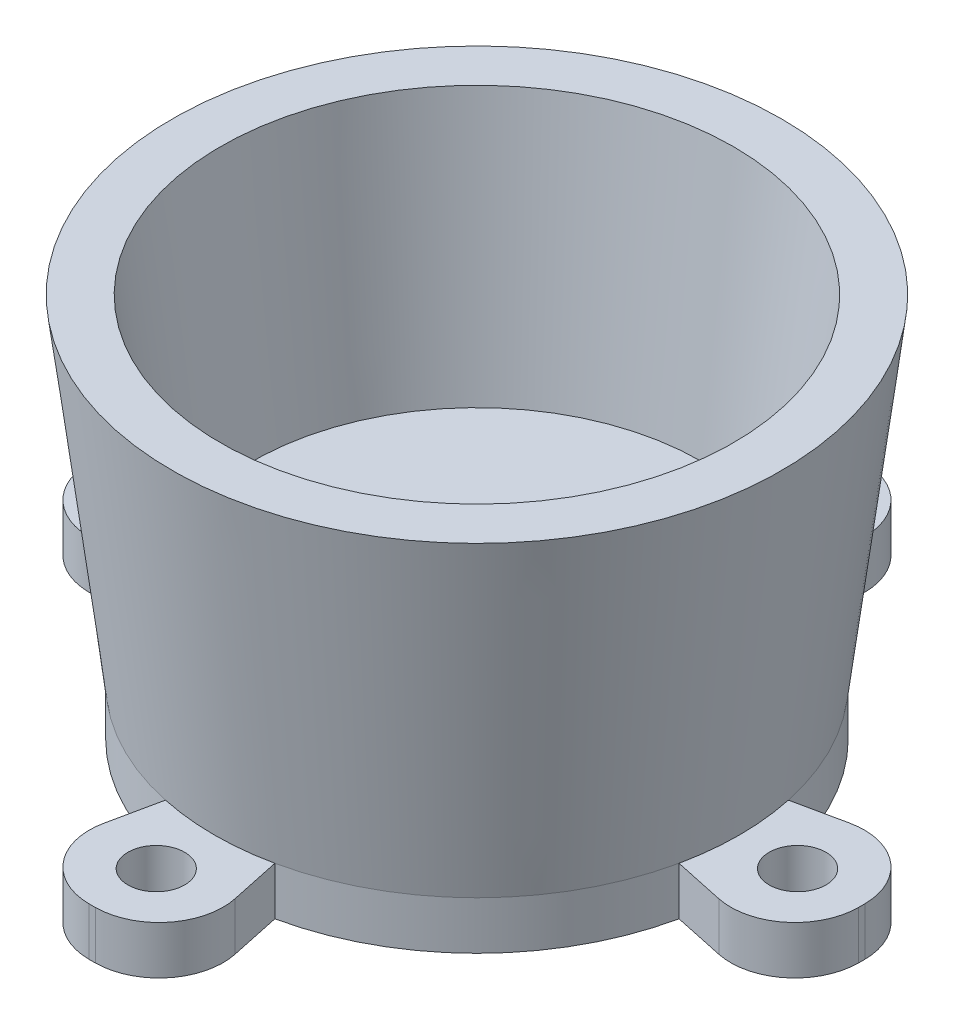
ISO-10303-21;
HEADER;
FILE_DESCRIPTION(('STEP AP214'),'2;1');
FILE_NAME('part.step','',(''),(''),'','','');
FILE_SCHEMA(('AUTOMOTIVE_DESIGN { 1 0 10303 214 1 1 1 1 }'));
ENDSEC;
DATA;
#1=APPLICATION_CONTEXT('core data for automotive mechanical design processes');
#2=APPLICATION_PROTOCOL_DEFINITION('international standard','automotive_design',2000,#1);
#3=PRODUCT_CONTEXT('',#1,'mechanical');
#4=PRODUCT('Part','Part','',(#3));
#5=PRODUCT_RELATED_PRODUCT_CATEGORY('part','',(#4));
#6=PRODUCT_DEFINITION_FORMATION('','',#4);
#7=PRODUCT_DEFINITION_CONTEXT('part definition',#1,'design');
#8=PRODUCT_DEFINITION('design','',#6,#7);
#9=PRODUCT_DEFINITION_SHAPE('','',#8);
#10=(LENGTH_UNIT() NAMED_UNIT(*) SI_UNIT(.MILLI.,.METRE.));
#11=(NAMED_UNIT(*) PLANE_ANGLE_UNIT() SI_UNIT($,.RADIAN.));
#12=(NAMED_UNIT(*) SI_UNIT($,.STERADIAN.) SOLID_ANGLE_UNIT());
#13=UNCERTAINTY_MEASURE_WITH_UNIT(LENGTH_MEASURE(1.E-05),#10,'distance_accuracy_value','');
#14=(GEOMETRIC_REPRESENTATION_CONTEXT(3) GLOBAL_UNCERTAINTY_ASSIGNED_CONTEXT((#13)) GLOBAL_UNIT_ASSIGNED_CONTEXT((#10,
#11,#12)) REPRESENTATION_CONTEXT('',''));
#15=CARTESIAN_POINT('',(0.,0.,0.));
#16=DIRECTION('',(0.,0.,1.));
#17=DIRECTION('',(1.,0.,0.));
#18=AXIS2_PLACEMENT_3D('',#15,#16,#17);
#19=CARTESIAN_POINT('',(3.01625,-6.35,0.));
#20=DIRECTION('',(0.,1.,0.));
#21=DIRECTION('',(0.,0.,1.));
#22=AXIS2_PLACEMENT_3D('',#19,#20,#21);
#23=PLANE('',#22);
#24=DIRECTION('',(0.208333333333331,0.,-0.978057882858792));
#25=VECTOR('',#24,1.);
#26=CARTESIAN_POINT('',(-22.1125520833333,-6.35,20.3399362464021));
#27=LINE('',#26,#25);
#28=CARTESIAN_POINT('',(-22.964753288891,-6.35,24.3407463594142));
#29=VERTEX_POINT('',#28);
#30=CARTESIAN_POINT('',(-22.1125520833333,-6.35,20.3399362464021));
#31=VERTEX_POINT('',#30);
#32=EDGE_CURVE('E346',#29,#31,#27,.T.);
#33=ORIENTED_EDGE('',*,*,#32,.F.);
#34=CARTESIAN_POINT('',(-17.9962192439684,-6.35,25.3990796927475));
#35=DIRECTION('',(0.,1.,0.));
#36=DIRECTION('',(0.,0.,1.));
#37=AXIS2_PLACEMENT_3D('',#34,#35,#36);
#38=CIRCLE('',#37,5.08);
#39=CARTESIAN_POINT('',(-18.0394630927621,-6.35,30.478895631297));
#40=VERTEX_POINT('',#39);
#41=EDGE_CURVE('E60',#29,#40,#38,.T.);
#42=ORIENTED_EDGE('',*,*,#41,.T.);
#43=CARTESIAN_POINT('',(-17.78,-6.35,0.));
#44=DIRECTION('',(0.,-1.,0.));
#45=DIRECTION('',(0.,0.,-1.));
#46=AXIS2_PLACEMENT_3D('',#43,#44,#45);
#47=CIRCLE('',#46,30.48);
#48=CARTESIAN_POINT('',(-17.5205369072379,-6.35,30.478895631297));
#49=VERTEX_POINT('',#48);
#50=EDGE_CURVE('E250',#49,#40,#47,.T.);
#51=ORIENTED_EDGE('',*,*,#50,.F.);
#52=CARTESIAN_POINT('',(-17.5637807560316,-6.35,25.3990796927475));
#53=DIRECTION('',(0.,1.,0.));
#54=DIRECTION('',(0.,0.,1.));
#55=AXIS2_PLACEMENT_3D('',#52,#53,#54);
#56=CIRCLE('',#55,5.08);
#57=CARTESIAN_POINT('',(-12.5952467111089,-6.35,24.3407463594142));
#58=VERTEX_POINT('',#57);
#59=EDGE_CURVE('E54',#49,#58,#56,.T.);
#60=ORIENTED_EDGE('',*,*,#59,.T.);
#61=DIRECTION('',(0.208333333333332,0.,0.978057882858792));
#62=VECTOR('',#61,1.);
#63=CARTESIAN_POINT('',(-13.4474479166666,-6.35,20.3399362464021));
#64=LINE('',#63,#62);
#65=CARTESIAN_POINT('',(-13.4474479166666,-6.35,20.3399362464021));
#66=VERTEX_POINT('',#65);
#67=EDGE_CURVE('E392',#66,#58,#64,.T.);
#68=ORIENTED_EDGE('',*,*,#67,.F.);
#69=CARTESIAN_POINT('',(-17.78,-6.35,0.));
#70=DIRECTION('',(0.,-1.,0.));
#71=DIRECTION('',(0.,0.,-1.));
#72=AXIS2_PLACEMENT_3D('',#69,#70,#71);
#73=CIRCLE('',#72,20.79625);
#74=EDGE_CURVE('E240',#66,#31,#73,.T.);
#75=ORIENTED_EDGE('',*,*,#74,.T.);
#76=EDGE_LOOP('',(#33,#42,#51,#60,#68,#75));
#77=FACE_BOUND('',#76,.T.);
#78=CARTESIAN_POINT('',(-17.78,-6.35,25.4));
#79=DIRECTION('',(0.,1.,0.));
#80=DIRECTION('',(0.,0.,1.));
#81=AXIS2_PLACEMENT_3D('',#78,#79,#80);
#82=CIRCLE('',#81,2.2479);
#83=CARTESIAN_POINT('',(-17.78,-6.35,27.6479));
#84=VERTEX_POINT('',#83);
#85=EDGE_CURVE('E367',#84,#84,#82,.T.);
#86=ORIENTED_EDGE('',*,*,#85,.F.);
#87=EDGE_LOOP('',(#86));
#88=FACE_BOUND('',#87,.T.);
#89=ADVANCED_FACE('F39',(#77,#88),#23,.T.);
#90=CARTESIAN_POINT('',(-18.0394630927621,-6.35,-30.478895631297));
#91=VERTEX_POINT('',#90);
#92=CARTESIAN_POINT('',(-17.5205369072379,-6.35,-30.478895631297));
#93=VERTEX_POINT('',#92);
#94=EDGE_CURVE('E412',#91,#93,#47,.T.);
#95=ORIENTED_EDGE('',*,*,#94,.F.);
#96=CARTESIAN_POINT('',(-17.9962192439684,-6.35,-25.3990796927475));
#97=DIRECTION('',(0.,1.,0.));
#98=DIRECTION('',(0.,0.,1.));
#99=AXIS2_PLACEMENT_3D('',#96,#97,#98);
#100=CIRCLE('',#99,5.08);
#101=CARTESIAN_POINT('',(-22.964753288891,-6.35,-24.3407463594142));
#102=VERTEX_POINT('',#101);
#103=EDGE_CURVE('E306',#91,#102,#100,.T.);
#104=ORIENTED_EDGE('',*,*,#103,.T.);
#105=DIRECTION('',(-0.208333333333331,0.,-0.978057882858792));
#106=VECTOR('',#105,1.);
#107=CARTESIAN_POINT('',(-22.1125520833333,-6.35,-20.3399362464021));
#108=LINE('',#107,#106);
#109=CARTESIAN_POINT('',(-22.1125520833333,-6.35,-20.3399362464021));
#110=VERTEX_POINT('',#109);
#111=EDGE_CURVE('E210',#110,#102,#108,.T.);
#112=ORIENTED_EDGE('',*,*,#111,.F.);
#113=CARTESIAN_POINT('',(-13.4474479166666,-6.35,-20.3399362464021));
#114=VERTEX_POINT('',#113);
#115=EDGE_CURVE('E231',#110,#114,#73,.T.);
#116=ORIENTED_EDGE('',*,*,#115,.T.);
#117=DIRECTION('',(-0.208333333333332,0.,0.978057882858792));
#118=VECTOR('',#117,1.);
#119=CARTESIAN_POINT('',(-13.4474479166666,-6.35,-20.3399362464021));
#120=LINE('',#119,#118);
#121=CARTESIAN_POINT('',(-12.5952467111089,-6.35,-24.3407463594142));
#122=VERTEX_POINT('',#121);
#123=EDGE_CURVE('E456',#122,#114,#120,.T.);
#124=ORIENTED_EDGE('',*,*,#123,.F.);
#125=CARTESIAN_POINT('',(-17.5637807560316,-6.35,-25.3990796927475));
#126=DIRECTION('',(0.,1.,0.));
#127=DIRECTION('',(0.,0.,1.));
#128=AXIS2_PLACEMENT_3D('',#125,#126,#127);
#129=CIRCLE('',#128,5.08);
#130=EDGE_CURVE('E304',#122,#93,#129,.T.);
#131=ORIENTED_EDGE('',*,*,#130,.T.);
#132=EDGE_LOOP('',(#95,#104,#112,#116,#124,#131));
#133=FACE_BOUND('',#132,.T.);
#134=CARTESIAN_POINT('',(-17.78,-6.35,-25.4));
#135=DIRECTION('',(0.,1.,0.));
#136=DIRECTION('',(0.,0.,-1.));
#137=AXIS2_PLACEMENT_3D('',#134,#135,#136);
#138=CIRCLE('',#137,2.2479);
#139=CARTESIAN_POINT('',(-17.78,-6.35,-27.6479));
#140=VERTEX_POINT('',#139);
#141=EDGE_CURVE('E374',#140,#140,#138,.T.);
#142=ORIENTED_EDGE('',*,*,#141,.F.);
#143=EDGE_LOOP('',(#142));
#144=FACE_BOUND('',#143,.T.);
#145=ADVANCED_FACE('F516',(#133,#144),#23,.T.);
#146=CARTESIAN_POINT('',(-48.258895631297,-6.35,0.259463092762078));
#147=VERTEX_POINT('',#146);
#148=CARTESIAN_POINT('',(-48.258895631297,-6.35,-0.259463092762078));
#149=VERTEX_POINT('',#148);
#150=EDGE_CURVE('E416',#147,#149,#47,.T.);
#151=ORIENTED_EDGE('',*,*,#150,.F.);
#152=CARTESIAN_POINT('',(-43.1790796927475,-6.35,0.216219243968399));
#153=DIRECTION('',(0.,1.,0.));
#154=DIRECTION('',(0.,0.,1.));
#155=AXIS2_PLACEMENT_3D('',#152,#153,#154);
#156=CIRCLE('',#155,5.08);
#157=CARTESIAN_POINT('',(-42.1207463594141,-6.35,5.18475328889106));
#158=VERTEX_POINT('',#157);
#159=EDGE_CURVE('E267',#147,#158,#156,.T.);
#160=ORIENTED_EDGE('',*,*,#159,.T.);
#161=DIRECTION('',(-0.978057882858792,0.,0.208333333333334));
#162=VECTOR('',#161,1.);
#163=CARTESIAN_POINT('',(-47.591204269536,-6.35,6.35));
#164=LINE('',#163,#162);
#165=CARTESIAN_POINT('',(-38.1199362464021,-6.35,4.33255208333334));
#166=VERTEX_POINT('',#165);
#167=EDGE_CURVE('E239',#166,#158,#164,.T.);
#168=ORIENTED_EDGE('',*,*,#167,.F.);
#169=CARTESIAN_POINT('',(-38.1199362464021,-6.35,-4.33255208333334));
#170=VERTEX_POINT('',#169);
#171=EDGE_CURVE('E229',#166,#170,#73,.T.);
#172=ORIENTED_EDGE('',*,*,#171,.T.);
#173=DIRECTION('',(0.978057882858792,0.,0.208333333333334));
#174=VECTOR('',#173,1.);
#175=CARTESIAN_POINT('',(-47.591204269536,-6.35,-6.35));
#176=LINE('',#175,#174);
#177=CARTESIAN_POINT('',(-42.1207463594141,-6.35,-5.18475328889106));
#178=VERTEX_POINT('',#177);
#179=EDGE_CURVE('E200',#178,#170,#176,.T.);
#180=ORIENTED_EDGE('',*,*,#179,.F.);
#181=CARTESIAN_POINT('',(-43.1790796927475,-6.35,-0.216219243968399));
#182=DIRECTION('',(0.,1.,0.));
#183=DIRECTION('',(0.,0.,1.));
#184=AXIS2_PLACEMENT_3D('',#181,#182,#183);
#185=CIRCLE('',#184,5.08);
#186=EDGE_CURVE('E265',#178,#149,#185,.T.);
#187=ORIENTED_EDGE('',*,*,#186,.T.);
#188=EDGE_LOOP('',(#151,#160,#168,#172,#180,#187));
#189=FACE_BOUND('',#188,.T.);
#190=CARTESIAN_POINT('',(-43.18,-6.35,0.));
#191=DIRECTION('',(0.,1.,0.));
#192=DIRECTION('',(0.,0.,1.));
#193=AXIS2_PLACEMENT_3D('',#190,#191,#192);
#194=CIRCLE('',#193,2.2479);
#195=CARTESIAN_POINT('',(-43.18,-6.35,2.2479));
#196=VERTEX_POINT('',#195);
#197=EDGE_CURVE('E221',#196,#196,#194,.T.);
#198=ORIENTED_EDGE('',*,*,#197,.F.);
#199=EDGE_LOOP('',(#198));
#200=FACE_BOUND('',#199,.T.);
#201=ADVANCED_FACE('F236',(#189,#200),#23,.T.);
#202=CARTESIAN_POINT('',(-17.78,-37.2110456847174,0.));
#203=DIRECTION('',(0.,-1.,0.));
#204=DIRECTION('',(0.,0.,-1.));
#205=AXIS2_PLACEMENT_3D('',#202,#203,#204);
#206=CYLINDRICAL_SURFACE('',#205,30.48);
#207=ORIENTED_EDGE('',*,*,#50,.T.);
#208=DIRECTION('',(0.,-1.,0.));
#209=VECTOR('',#208,1.);
#210=CARTESIAN_POINT('',(-18.0394630927621,-37.2110456847174,30.478895631297));
#211=LINE('',#210,#209);
#212=CARTESIAN_POINT('',(-18.0394630927621,-10.16,30.478895631297));
#213=VERTEX_POINT('',#212);
#214=EDGE_CURVE('E47',#40,#213,#211,.T.);
#215=ORIENTED_EDGE('',*,*,#214,.T.);
#216=CARTESIAN_POINT('',(-17.78,-10.16,0.));
#217=DIRECTION('',(0.,-1.,0.));
#218=DIRECTION('',(0.,0.,-1.));
#219=AXIS2_PLACEMENT_3D('',#216,#217,#218);
#220=CIRCLE('',#219,30.48);
#221=CARTESIAN_POINT('',(-17.5205369072379,-10.16,30.478895631297));
#222=VERTEX_POINT('',#221);
#223=EDGE_CURVE('E328',#222,#213,#220,.T.);
#224=ORIENTED_EDGE('',*,*,#223,.F.);
#225=DIRECTION('',(0.,-1.,0.));
#226=VECTOR('',#225,1.);
#227=CARTESIAN_POINT('',(-17.5205369072379,-37.2110456847174,30.478895631297));
#228=LINE('',#227,#226);
#229=EDGE_CURVE('E321',#222,#49,#228,.F.);
#230=ORIENTED_EDGE('',*,*,#229,.T.);
#231=EDGE_LOOP('',(#207,#215,#224,#230));
#232=FACE_BOUND('',#231,.T.);
#233=ADVANCED_FACE('F327',(#232),#206,.T.);
#234=CARTESIAN_POINT('',(-18.0394630927621,-10.16,-30.478895631297));
#235=VERTEX_POINT('',#234);
#236=CARTESIAN_POINT('',(-17.5205369072379,-10.16,-30.478895631297));
#237=VERTEX_POINT('',#236);
#238=EDGE_CURVE('E404',#235,#237,#220,.T.);
#239=ORIENTED_EDGE('',*,*,#238,.F.);
#240=DIRECTION('',(0.,-1.,0.));
#241=VECTOR('',#240,1.);
#242=CARTESIAN_POINT('',(-18.0394630927621,-37.2110456847174,-30.478895631297));
#243=LINE('',#242,#241);
#244=EDGE_CURVE('E301',#235,#91,#243,.F.);
#245=ORIENTED_EDGE('',*,*,#244,.T.);
#246=ORIENTED_EDGE('',*,*,#94,.T.);
#247=DIRECTION('',(0.,-1.,0.));
#248=VECTOR('',#247,1.);
#249=CARTESIAN_POINT('',(-17.5205369072379,-37.2110456847174,-30.478895631297));
#250=LINE('',#249,#248);
#251=EDGE_CURVE('E299',#93,#237,#250,.T.);
#252=ORIENTED_EDGE('',*,*,#251,.T.);
#253=EDGE_LOOP('',(#239,#245,#246,#252));
#254=FACE_BOUND('',#253,.T.);
#255=ADVANCED_FACE('F537',(#254),#206,.T.);
#256=CARTESIAN_POINT('',(-48.258895631297,-10.16,0.259463092762078));
#257=VERTEX_POINT('',#256);
#258=CARTESIAN_POINT('',(-48.258895631297,-10.16,-0.259463092762078));
#259=VERTEX_POINT('',#258);
#260=EDGE_CURVE('E340',#257,#259,#220,.T.);
#261=ORIENTED_EDGE('',*,*,#260,.F.);
#262=DIRECTION('',(0.,-1.,0.));
#263=VECTOR('',#262,1.);
#264=CARTESIAN_POINT('',(-48.258895631297,-37.2110456847174,0.259463092762078));
#265=LINE('',#264,#263);
#266=EDGE_CURVE('E262',#257,#147,#265,.F.);
#267=ORIENTED_EDGE('',*,*,#266,.T.);
#268=ORIENTED_EDGE('',*,*,#150,.T.);
#269=DIRECTION('',(0.,-1.,0.));
#270=VECTOR('',#269,1.);
#271=CARTESIAN_POINT('',(-48.258895631297,-37.2110456847174,-0.259463092762078));
#272=LINE('',#271,#270);
#273=EDGE_CURVE('E260',#149,#259,#272,.T.);
#274=ORIENTED_EDGE('',*,*,#273,.T.);
#275=EDGE_LOOP('',(#261,#267,#268,#274));
#276=FACE_BOUND('',#275,.T.);
#277=ADVANCED_FACE('F499',(#276),#206,.T.);
#278=CARTESIAN_POINT('',(-17.78,0.,0.));
#279=DIRECTION('',(0.,1.,0.));
#280=DIRECTION('',(0.,0.,1.));
#281=AXIS2_PLACEMENT_3D('',#278,#279,#280);
#282=PLANE('',#281);
#283=CARTESIAN_POINT('',(-17.78,0.,0.));
#284=DIRECTION('',(0.,-1.,0.));
#285=DIRECTION('',(0.,0.,-1.));
#286=AXIS2_PLACEMENT_3D('',#283,#284,#285);
#287=CIRCLE('',#286,17.78);
#288=CARTESIAN_POINT('',(-17.78,0.,-17.78));
#289=VERTEX_POINT('',#288);
#290=EDGE_CURVE('E257',#289,#289,#287,.T.);
#291=ORIENTED_EDGE('',*,*,#290,.F.);
#292=EDGE_LOOP('',(#291));
#293=FACE_BOUND('',#292,.T.);
#294=ADVANCED_FACE('F824',(#293),#282,.T.);
#295=CARTESIAN_POINT('',(-17.78,20.32,0.));
#296=DIRECTION('',(0.,1.,0.));
#297=DIRECTION('',(0.,0.,1.));
#298=AXIS2_PLACEMENT_3D('',#295,#296,#297);
#299=CONICAL_SURFACE('',#298,20.32,0.124354994546762);
#300=ORIENTED_EDGE('',*,*,#290,.T.);
#301=EDGE_LOOP('',(#300));
#302=FACE_BOUND('',#301,.T.);
#303=CARTESIAN_POINT('',(-17.78,20.32,0.));
#304=DIRECTION('',(0.,-1.,0.));
#305=DIRECTION('',(0.,0.,-1.));
#306=AXIS2_PLACEMENT_3D('',#303,#304,#305);
#307=CIRCLE('',#306,20.32);
#308=CARTESIAN_POINT('',(-17.78,20.32,-20.32));
#309=VERTEX_POINT('',#308);
#310=EDGE_CURVE('E254',#309,#309,#307,.T.);
#311=ORIENTED_EDGE('',*,*,#310,.F.);
#312=EDGE_LOOP('',(#311));
#313=FACE_BOUND('',#312,.T.);
#314=ADVANCED_FACE('F867',(#302,#313),#299,.F.);
#315=CARTESIAN_POINT('',(2.54,20.32,0.));
#316=DIRECTION('',(0.,1.,0.));
#317=DIRECTION('',(0.,0.,1.));
#318=AXIS2_PLACEMENT_3D('',#315,#316,#317);
#319=PLANE('',#318);
#320=ORIENTED_EDGE('',*,*,#310,.T.);
#321=EDGE_LOOP('',(#320));
#322=FACE_BOUND('',#321,.T.);
#323=CARTESIAN_POINT('',(-17.78,20.32,0.));
#324=DIRECTION('',(0.,-1.,0.));
#325=DIRECTION('',(0.,0.,-1.));
#326=AXIS2_PLACEMENT_3D('',#323,#324,#325);
#327=CIRCLE('',#326,24.13);
#328=CARTESIAN_POINT('',(-17.78,20.32,-24.13));
#329=VERTEX_POINT('',#328);
#330=EDGE_CURVE('E249',#329,#329,#327,.T.);
#331=ORIENTED_EDGE('',*,*,#330,.F.);
#332=EDGE_LOOP('',(#331));
#333=FACE_BOUND('',#332,.T.);
#334=ADVANCED_FACE('F530',(#322,#333),#319,.T.);
#335=CARTESIAN_POINT('',(-17.78,-6.35,0.));
#336=DIRECTION('',(0.,1.,0.));
#337=DIRECTION('',(0.,0.,1.));
#338=AXIS2_PLACEMENT_3D('',#335,#336,#337);
#339=CONICAL_SURFACE('',#338,20.79625,0.124354994546761);
#340=ORIENTED_EDGE('',*,*,#330,.T.);
#341=EDGE_LOOP('',(#340));
#342=FACE_BOUND('',#341,.T.);
#343=CARTESIAN_POINT('',(2.55993624640218,-6.35,-4.33255208333334));
#344=VERTEX_POINT('',#343);
#345=EDGE_CURVE('E245',#114,#344,#73,.T.);
#346=ORIENTED_EDGE('',*,*,#345,.F.);
#347=ORIENTED_EDGE('',*,*,#115,.F.);
#348=CARTESIAN_POINT('',(-17.78,-6.35,0.));
#349=DIRECTION('',(0.,-1.,0.));
#350=DIRECTION('',(0.,0.,1.));
#351=AXIS2_PLACEMENT_3D('',#348,#349,#350);
#352=CIRCLE('',#351,20.79625);
#353=EDGE_CURVE('E217',#170,#110,#352,.T.);
#354=ORIENTED_EDGE('',*,*,#353,.F.);
#355=ORIENTED_EDGE('',*,*,#171,.F.);
#356=CARTESIAN_POINT('',(-17.78,-6.35,0.));
#357=DIRECTION('',(0.,-1.,0.));
#358=DIRECTION('',(0.,0.,-1.));
#359=AXIS2_PLACEMENT_3D('',#356,#357,#358);
#360=CIRCLE('',#359,20.79625);
#361=EDGE_CURVE('E353',#31,#166,#360,.T.);
#362=ORIENTED_EDGE('',*,*,#361,.F.);
#363=ORIENTED_EDGE('',*,*,#74,.F.);
#364=CARTESIAN_POINT('',(-17.78,-6.35,0.));
#365=DIRECTION('',(0.,-1.,0.));
#366=DIRECTION('',(0.,0.,1.));
#367=AXIS2_PLACEMENT_3D('',#364,#365,#366);
#368=CIRCLE('',#367,20.79625);
#369=CARTESIAN_POINT('',(2.55993624640218,-6.35,4.33255208333334));
#370=VERTEX_POINT('',#369);
#371=EDGE_CURVE('E370',#370,#66,#368,.T.);
#372=ORIENTED_EDGE('',*,*,#371,.F.);
#373=EDGE_CURVE('E243',#344,#370,#73,.T.);
#374=ORIENTED_EDGE('',*,*,#373,.F.);
#375=EDGE_LOOP('',(#346,#347,#354,#355,#362,#363,#372,#374));
#376=FACE_BOUND('',#375,.T.);
#377=ADVANCED_FACE('F227',(#342,#376),#339,.T.);
#378=DIRECTION('',(-0.978057882858792,0.,-0.208333333333333));
#379=VECTOR('',#378,1.);
#380=CARTESIAN_POINT('',(12.031204269536,-6.35,6.35));
#381=LINE('',#380,#379);
#382=CARTESIAN_POINT('',(6.56074635941415,-6.35,5.18475328889106));
#383=VERTEX_POINT('',#382);
#384=EDGE_CURVE('E385',#383,#370,#381,.T.);
#385=ORIENTED_EDGE('',*,*,#384,.F.);
#386=CARTESIAN_POINT('',(7.61907969274748,-6.35,0.216219243968394));
#387=DIRECTION('',(0.,1.,0.));
#388=DIRECTION('',(0.,0.,1.));
#389=AXIS2_PLACEMENT_3D('',#386,#387,#388);
#390=CIRCLE('',#389,5.08);
#391=CARTESIAN_POINT('',(12.698895631297,-6.35,0.259463092762073));
#392=VERTEX_POINT('',#391);
#393=EDGE_CURVE('E292',#383,#392,#390,.T.);
#394=ORIENTED_EDGE('',*,*,#393,.T.);
#395=CARTESIAN_POINT('',(12.698895631297,-6.35,-0.259463092762073));
#396=VERTEX_POINT('',#395);
#397=EDGE_CURVE('E244',#396,#392,#47,.T.);
#398=ORIENTED_EDGE('',*,*,#397,.F.);
#399=CARTESIAN_POINT('',(7.61907969274748,-6.35,-0.216219243968394));
#400=DIRECTION('',(0.,1.,0.));
#401=DIRECTION('',(0.,0.,1.));
#402=AXIS2_PLACEMENT_3D('',#399,#400,#401);
#403=CIRCLE('',#402,5.08);
#404=CARTESIAN_POINT('',(6.56074635941415,-6.35,-5.18475328889106));
#405=VERTEX_POINT('',#404);
#406=EDGE_CURVE('E290',#396,#405,#403,.T.);
#407=ORIENTED_EDGE('',*,*,#406,.T.);
#408=DIRECTION('',(0.978057882858792,0.,-0.208333333333333));
#409=VECTOR('',#408,1.);
#410=CARTESIAN_POINT('',(12.031204269536,-6.35,-6.35));
#411=LINE('',#410,#409);
#412=EDGE_CURVE('E380',#344,#405,#411,.T.);
#413=ORIENTED_EDGE('',*,*,#412,.F.);
#414=ORIENTED_EDGE('',*,*,#373,.T.);
#415=EDGE_LOOP('',(#385,#394,#398,#407,#413,#414));
#416=FACE_BOUND('',#415,.T.);
#417=CARTESIAN_POINT('',(7.62000000000001,-6.35,0.));
#418=DIRECTION('',(0.,1.,0.));
#419=DIRECTION('',(0.,0.,1.));
#420=AXIS2_PLACEMENT_3D('',#417,#418,#419);
#421=CIRCLE('',#420,2.2479);
#422=CARTESIAN_POINT('',(7.62000000000001,-6.35,2.2479));
#423=VERTEX_POINT('',#422);
#424=EDGE_CURVE('E472',#423,#423,#421,.T.);
#425=ORIENTED_EDGE('',*,*,#424,.F.);
#426=EDGE_LOOP('',(#425));
#427=FACE_BOUND('',#426,.T.);
#428=ADVANCED_FACE('F518',(#416,#427),#23,.T.);
#429=ORIENTED_EDGE('',*,*,#397,.T.);
#430=DIRECTION('',(0.,-1.,0.));
#431=VECTOR('',#430,1.);
#432=CARTESIAN_POINT('',(12.698895631297,-37.2110456847174,0.259463092762073));
#433=LINE('',#432,#431);
#434=CARTESIAN_POINT('',(12.698895631297,-10.16,0.259463092762073));
#435=VERTEX_POINT('',#434);
#436=EDGE_CURVE('E297',#392,#435,#433,.T.);
#437=ORIENTED_EDGE('',*,*,#436,.T.);
#438=CARTESIAN_POINT('',(12.698895631297,-10.16,-0.259463092762073));
#439=VERTEX_POINT('',#438);
#440=EDGE_CURVE('E339',#439,#435,#220,.T.);
#441=ORIENTED_EDGE('',*,*,#440,.F.);
#442=DIRECTION('',(0.,-1.,0.));
#443=VECTOR('',#442,1.);
#444=CARTESIAN_POINT('',(12.698895631297,-37.2110456847174,-0.259463092762073));
#445=LINE('',#444,#443);
#446=EDGE_CURVE('E294',#439,#396,#445,.F.);
#447=ORIENTED_EDGE('',*,*,#446,.T.);
#448=EDGE_LOOP('',(#429,#437,#441,#447));
#449=FACE_BOUND('',#448,.T.);
#450=ADVANCED_FACE('F425',(#449),#206,.T.);
#451=CARTESIAN_POINT('',(12.7,-10.16,0.));
#452=DIRECTION('',(0.,-1.,0.));
#453=DIRECTION('',(0.,0.,-1.));
#454=AXIS2_PLACEMENT_3D('',#451,#452,#453);
#455=PLANE('',#454);
#456=DIRECTION('',(-0.978057882858792,0.,0.208333333333334));
#457=VECTOR('',#456,1.);
#458=CARTESIAN_POINT('',(-47.591204269536,-10.16,6.35));
#459=LINE('',#458,#457);
#460=CARTESIAN_POINT('',(-38.1199362464021,-10.16,4.33255208333334));
#461=VERTEX_POINT('',#460);
#462=CARTESIAN_POINT('',(-42.1207463594141,-10.16,5.18475328889106));
#463=VERTEX_POINT('',#462);
#464=EDGE_CURVE('E356',#461,#463,#459,.T.);
#465=ORIENTED_EDGE('',*,*,#464,.T.);
#466=CARTESIAN_POINT('',(-43.1790796927475,-10.16,0.216219243968399));
#467=DIRECTION('',(0.,-1.,0.));
#468=DIRECTION('',(0.,0.,-1.));
#469=AXIS2_PLACEMENT_3D('',#466,#467,#468);
#470=CIRCLE('',#469,5.08);
#471=EDGE_CURVE('E285',#463,#257,#470,.T.);
#472=ORIENTED_EDGE('',*,*,#471,.T.);
#473=ORIENTED_EDGE('',*,*,#260,.T.);
#474=CARTESIAN_POINT('',(-43.1790796927475,-10.16,-0.216219243968399));
#475=DIRECTION('',(0.,-1.,0.));
#476=DIRECTION('',(0.,0.,-1.));
#477=AXIS2_PLACEMENT_3D('',#474,#475,#476);
#478=CIRCLE('',#477,5.08);
#479=CARTESIAN_POINT('',(-42.1207463594141,-10.16,-5.18475328889106));
#480=VERTEX_POINT('',#479);
#481=EDGE_CURVE('E275',#259,#480,#478,.T.);
#482=ORIENTED_EDGE('',*,*,#481,.T.);
#483=DIRECTION('',(0.978057882858792,0.,0.208333333333334));
#484=VECTOR('',#483,1.);
#485=CARTESIAN_POINT('',(-47.591204269536,-10.16,-6.35));
#486=LINE('',#485,#484);
#487=CARTESIAN_POINT('',(-38.1199362464021,-10.16,-4.33255208333334));
#488=VERTEX_POINT('',#487);
#489=EDGE_CURVE('E484',#480,#488,#486,.T.);
#490=ORIENTED_EDGE('',*,*,#489,.T.);
#491=CARTESIAN_POINT('',(-17.78,-10.16,0.));
#492=DIRECTION('',(0.,-1.,0.));
#493=DIRECTION('',(0.,0.,1.));
#494=AXIS2_PLACEMENT_3D('',#491,#492,#493);
#495=CIRCLE('',#494,20.79625);
#496=CARTESIAN_POINT('',(-22.1125520833333,-10.16,-20.3399362464021));
#497=VERTEX_POINT('',#496);
#498=EDGE_CURVE('E211',#488,#497,#495,.T.);
#499=ORIENTED_EDGE('',*,*,#498,.T.);
#500=DIRECTION('',(-0.208333333333331,0.,-0.978057882858792));
#501=VECTOR('',#500,1.);
#502=CARTESIAN_POINT('',(-22.1125520833333,-10.16,-20.3399362464021));
#503=LINE('',#502,#501);
#504=CARTESIAN_POINT('',(-22.964753288891,-10.16,-24.3407463594142));
#505=VERTEX_POINT('',#504);
#506=EDGE_CURVE('E481',#497,#505,#503,.T.);
#507=ORIENTED_EDGE('',*,*,#506,.T.);
#508=CARTESIAN_POINT('',(-17.9962192439684,-10.16,-25.3990796927475));
#509=DIRECTION('',(0.,-1.,0.));
#510=DIRECTION('',(0.,0.,-1.));
#511=AXIS2_PLACEMENT_3D('',#508,#509,#510);
#512=CIRCLE('',#511,5.08);
#513=EDGE_CURVE('E281',#505,#235,#512,.T.);
#514=ORIENTED_EDGE('',*,*,#513,.T.);
#515=ORIENTED_EDGE('',*,*,#238,.T.);
#516=CARTESIAN_POINT('',(-17.5637807560316,-10.16,-25.3990796927475));
#517=DIRECTION('',(0.,-1.,0.));
#518=DIRECTION('',(0.,0.,-1.));
#519=AXIS2_PLACEMENT_3D('',#516,#517,#518);
#520=CIRCLE('',#519,5.08);
#521=CARTESIAN_POINT('',(-12.5952467111089,-10.16,-24.3407463594142));
#522=VERTEX_POINT('',#521);
#523=EDGE_CURVE('E277',#237,#522,#520,.T.);
#524=ORIENTED_EDGE('',*,*,#523,.T.);
#525=DIRECTION('',(-0.208333333333332,0.,0.978057882858792));
#526=VECTOR('',#525,1.);
#527=CARTESIAN_POINT('',(-13.4474479166666,-10.16,-20.3399362464021));
#528=LINE('',#527,#526);
#529=CARTESIAN_POINT('',(-13.4474479166666,-10.16,-20.3399362464021));
#530=VERTEX_POINT('',#529);
#531=EDGE_CURVE('E460',#522,#530,#528,.T.);
#532=ORIENTED_EDGE('',*,*,#531,.T.);
#533=CARTESIAN_POINT('',(-17.78,-10.16,0.));
#534=DIRECTION('',(0.,-1.,0.));
#535=DIRECTION('',(0.,0.,-1.));
#536=AXIS2_PLACEMENT_3D('',#533,#534,#535);
#537=CIRCLE('',#536,20.79625);
#538=CARTESIAN_POINT('',(2.55993624640218,-10.16,-4.33255208333334));
#539=VERTEX_POINT('',#538);
#540=EDGE_CURVE('E453',#530,#539,#537,.T.);
#541=ORIENTED_EDGE('',*,*,#540,.T.);
#542=DIRECTION('',(0.978057882858792,0.,-0.208333333333333));
#543=VECTOR('',#542,1.);
#544=CARTESIAN_POINT('',(12.031204269536,-10.16,-6.35));
#545=LINE('',#544,#543);
#546=CARTESIAN_POINT('',(6.56074635941415,-10.16,-5.18475328889106));
#547=VERTEX_POINT('',#546);
#548=EDGE_CURVE('E457',#539,#547,#545,.T.);
#549=ORIENTED_EDGE('',*,*,#548,.T.);
#550=CARTESIAN_POINT('',(7.61907969274748,-10.16,-0.216219243968394));
#551=DIRECTION('',(0.,-1.,0.));
#552=DIRECTION('',(0.,0.,-1.));
#553=AXIS2_PLACEMENT_3D('',#550,#551,#552);
#554=CIRCLE('',#553,5.08);
#555=EDGE_CURVE('E279',#547,#439,#554,.T.);
#556=ORIENTED_EDGE('',*,*,#555,.T.);
#557=ORIENTED_EDGE('',*,*,#440,.T.);
#558=CARTESIAN_POINT('',(7.61907969274748,-10.16,0.216219243968394));
#559=DIRECTION('',(0.,-1.,0.));
#560=DIRECTION('',(0.,0.,-1.));
#561=AXIS2_PLACEMENT_3D('',#558,#559,#560);
#562=CIRCLE('',#561,5.08);
#563=CARTESIAN_POINT('',(6.56074635941415,-10.16,5.18475328889106));
#564=VERTEX_POINT('',#563);
#565=EDGE_CURVE('E283',#435,#564,#562,.T.);
#566=ORIENTED_EDGE('',*,*,#565,.T.);
#567=DIRECTION('',(-0.978057882858792,0.,-0.208333333333333));
#568=VECTOR('',#567,1.);
#569=CARTESIAN_POINT('',(12.031204269536,-10.16,6.35));
#570=LINE('',#569,#568);
#571=CARTESIAN_POINT('',(2.55993624640218,-10.16,4.33255208333334));
#572=VERTEX_POINT('',#571);
#573=EDGE_CURVE('E387',#564,#572,#570,.T.);
#574=ORIENTED_EDGE('',*,*,#573,.T.);
#575=CARTESIAN_POINT('',(-17.78,-10.16,0.));
#576=DIRECTION('',(0.,-1.,0.));
#577=DIRECTION('',(0.,0.,1.));
#578=AXIS2_PLACEMENT_3D('',#575,#576,#577);
#579=CIRCLE('',#578,20.79625);
#580=CARTESIAN_POINT('',(-13.4474479166666,-10.16,20.3399362464021));
#581=VERTEX_POINT('',#580);
#582=EDGE_CURVE('E381',#572,#581,#579,.T.);
#583=ORIENTED_EDGE('',*,*,#582,.T.);
#584=DIRECTION('',(0.208333333333332,0.,0.978057882858792));
#585=VECTOR('',#584,1.);
#586=CARTESIAN_POINT('',(-13.4474479166666,-10.16,20.3399362464021));
#587=LINE('',#586,#585);
#588=CARTESIAN_POINT('',(-12.5952467111089,-10.16,24.3407463594142));
#589=VERTEX_POINT('',#588);
#590=EDGE_CURVE('E384',#581,#589,#587,.T.);
#591=ORIENTED_EDGE('',*,*,#590,.T.);
#592=CARTESIAN_POINT('',(-17.5637807560316,-10.16,25.3990796927475));
#593=DIRECTION('',(0.,-1.,0.));
#594=DIRECTION('',(0.,0.,-1.));
#595=AXIS2_PLACEMENT_3D('',#592,#593,#594);
#596=CIRCLE('',#595,5.08);
#597=EDGE_CURVE('E271',#589,#222,#596,.T.);
#598=ORIENTED_EDGE('',*,*,#597,.T.);
#599=ORIENTED_EDGE('',*,*,#223,.T.);
#600=CARTESIAN_POINT('',(-17.9962192439684,-10.16,25.3990796927475));
#601=DIRECTION('',(0.,-1.,0.));
#602=DIRECTION('',(0.,0.,-1.));
#603=AXIS2_PLACEMENT_3D('',#600,#601,#602);
#604=CIRCLE('',#603,5.08);
#605=CARTESIAN_POINT('',(-22.964753288891,-10.16,24.3407463594142));
#606=VERTEX_POINT('',#605);
#607=EDGE_CURVE('E273',#213,#606,#604,.T.);
#608=ORIENTED_EDGE('',*,*,#607,.T.);
#609=DIRECTION('',(0.208333333333331,0.,-0.978057882858792));
#610=VECTOR('',#609,1.);
#611=CARTESIAN_POINT('',(-22.1125520833333,-10.16,20.3399362464021));
#612=LINE('',#611,#610);
#613=CARTESIAN_POINT('',(-22.1125520833333,-10.16,20.3399362464021));
#614=VERTEX_POINT('',#613);
#615=EDGE_CURVE('E348',#606,#614,#612,.T.);
#616=ORIENTED_EDGE('',*,*,#615,.T.);
#617=CARTESIAN_POINT('',(-17.78,-10.16,0.));
#618=DIRECTION('',(0.,-1.,0.));
#619=DIRECTION('',(0.,0.,-1.));
#620=AXIS2_PLACEMENT_3D('',#617,#618,#619);
#621=CIRCLE('',#620,20.79625);
#622=EDGE_CURVE('E351',#614,#461,#621,.T.);
#623=ORIENTED_EDGE('',*,*,#622,.T.);
#624=EDGE_LOOP('',(#465,#472,#473,#482,#490,#499,#507,#514,#515,#524,#532,#541,#549,#556,#557,
#566,#574,#583,#591,#598,#599,#608,#616,#623));
#625=FACE_BOUND('',#624,.T.);
#626=CARTESIAN_POINT('',(-17.78,-10.16,-25.4));
#627=DIRECTION('',(0.,1.,0.));
#628=DIRECTION('',(0.,0.,-1.));
#629=AXIS2_PLACEMENT_3D('',#626,#627,#628);
#630=CIRCLE('',#629,2.2479);
#631=CARTESIAN_POINT('',(-17.78,-10.16,-27.6479));
#632=VERTEX_POINT('',#631);
#633=EDGE_CURVE('E377',#632,#632,#630,.T.);
#634=ORIENTED_EDGE('',*,*,#633,.T.);
#635=EDGE_LOOP('',(#634));
#636=FACE_BOUND('',#635,.T.);
#637=CARTESIAN_POINT('',(-17.78,-10.16,25.4));
#638=DIRECTION('',(0.,1.,0.));
#639=DIRECTION('',(0.,0.,1.));
#640=AXIS2_PLACEMENT_3D('',#637,#638,#639);
#641=CIRCLE('',#640,2.2479);
#642=CARTESIAN_POINT('',(-17.78,-10.16,27.6479));
#643=VERTEX_POINT('',#642);
#644=EDGE_CURVE('E371',#643,#643,#641,.T.);
#645=ORIENTED_EDGE('',*,*,#644,.T.);
#646=EDGE_LOOP('',(#645));
#647=FACE_BOUND('',#646,.T.);
#648=CARTESIAN_POINT('',(-43.18,-10.16,0.));
#649=DIRECTION('',(0.,1.,0.));
#650=DIRECTION('',(0.,0.,1.));
#651=AXIS2_PLACEMENT_3D('',#648,#649,#650);
#652=CIRCLE('',#651,2.2479);
#653=CARTESIAN_POINT('',(-43.18,-10.16,2.2479));
#654=VERTEX_POINT('',#653);
#655=EDGE_CURVE('E475',#654,#654,#652,.T.);
#656=ORIENTED_EDGE('',*,*,#655,.T.);
#657=EDGE_LOOP('',(#656));
#658=FACE_BOUND('',#657,.T.);
#659=CARTESIAN_POINT('',(7.62000000000001,-10.16,0.));
#660=DIRECTION('',(0.,1.,0.));
#661=DIRECTION('',(0.,0.,1.));
#662=AXIS2_PLACEMENT_3D('',#659,#660,#661);
#663=CIRCLE('',#662,2.2479);
#664=CARTESIAN_POINT('',(7.62000000000001,-10.16,2.2479));
#665=VERTEX_POINT('',#664);
#666=EDGE_CURVE('E469',#665,#665,#663,.T.);
#667=ORIENTED_EDGE('',*,*,#666,.T.);
#668=EDGE_LOOP('',(#667));
#669=FACE_BOUND('',#668,.T.);
#670=CARTESIAN_POINT('',(-17.78,-10.16,0.));
#671=DIRECTION('',(0.,-1.,0.));
#672=DIRECTION('',(0.,0.,-1.));
#673=AXIS2_PLACEMENT_3D('',#670,#671,#672);
#674=CIRCLE('',#673,17.78);
#675=CARTESIAN_POINT('',(-17.78,-10.16,-17.78));
#676=VERTEX_POINT('',#675);
#677=EDGE_CURVE('E402',#676,#676,#674,.T.);
#678=ORIENTED_EDGE('',*,*,#677,.F.);
#679=EDGE_LOOP('',(#678));
#680=FACE_BOUND('',#679,.T.);
#681=ADVANCED_FACE('F334',(#625,#636,#647,#658,#669,#680),#455,.T.);
#682=CARTESIAN_POINT('',(-17.78,-37.2110456847174,0.));
#683=DIRECTION('',(0.,-1.,0.));
#684=DIRECTION('',(0.,0.,-1.));
#685=AXIS2_PLACEMENT_3D('',#682,#683,#684);
#686=CYLINDRICAL_SURFACE('',#685,17.78);
#687=ORIENTED_EDGE('',*,*,#677,.T.);
#688=EDGE_LOOP('',(#687));
#689=FACE_BOUND('',#688,.T.);
#690=CARTESIAN_POINT('',(-17.78,-5.08,0.));
#691=DIRECTION('',(0.,-1.,0.));
#692=DIRECTION('',(0.,0.,-1.));
#693=AXIS2_PLACEMENT_3D('',#690,#691,#692);
#694=CIRCLE('',#693,17.78);
#695=CARTESIAN_POINT('',(-17.78,-5.08,-17.78));
#696=VERTEX_POINT('',#695);
#697=EDGE_CURVE('E398',#696,#696,#694,.T.);
#698=ORIENTED_EDGE('',*,*,#697,.F.);
#699=EDGE_LOOP('',(#698));
#700=FACE_BOUND('',#699,.T.);
#701=ADVANCED_FACE('F544',(#689,#700),#686,.F.);
#702=CARTESIAN_POINT('',(0.,-5.08,0.));
#703=DIRECTION('',(0.,-1.,0.));
#704=DIRECTION('',(0.,0.,-1.));
#705=AXIS2_PLACEMENT_3D('',#702,#703,#704);
#706=PLANE('',#705);
#707=ORIENTED_EDGE('',*,*,#697,.T.);
#708=EDGE_LOOP('',(#707));
#709=FACE_BOUND('',#708,.T.);
#710=ADVANCED_FACE('F547',(#709),#706,.T.);
#711=CARTESIAN_POINT('',(-17.78,-10.16,0.));
#712=DIRECTION('',(0.,1.,0.));
#713=DIRECTION('',(0.,0.,1.));
#714=AXIS2_PLACEMENT_3D('',#711,#712,#713);
#715=CYLINDRICAL_SURFACE('',#714,20.79625);
#716=ORIENTED_EDGE('',*,*,#371,.T.);
#717=DIRECTION('',(0.,1.,0.));
#718=VECTOR('',#717,1.);
#719=CARTESIAN_POINT('',(-13.4474479166666,-10.16,20.3399362464021));
#720=LINE('',#719,#718);
#721=EDGE_CURVE('E389',#581,#66,#720,.T.);
#722=ORIENTED_EDGE('',*,*,#721,.F.);
#723=ORIENTED_EDGE('',*,*,#582,.F.);
#724=DIRECTION('',(0.,1.,0.));
#725=VECTOR('',#724,1.);
#726=CARTESIAN_POINT('',(2.55993624640218,-10.16,4.33255208333334));
#727=LINE('',#726,#725);
#728=EDGE_CURVE('E395',#572,#370,#727,.T.);
#729=ORIENTED_EDGE('',*,*,#728,.T.);
#730=EDGE_LOOP('',(#716,#722,#723,#729));
#731=FACE_BOUND('',#730,.T.);
#732=ADVANCED_FACE('F439',(#731),#715,.T.);
#733=CARTESIAN_POINT('',(12.031204269536,-10.16,6.35));
#734=DIRECTION('',(0.208333333333334,0.,-0.978057882858792));
#735=DIRECTION('',(-0.978057882858792,0.,-0.208333333333334));
#736=AXIS2_PLACEMENT_3D('',#733,#734,#735);
#737=PLANE('',#736);
#738=ORIENTED_EDGE('',*,*,#573,.F.);
#739=DIRECTION('',(0.,1.,0.));
#740=VECTOR('',#739,1.);
#741=CARTESIAN_POINT('',(6.56074635941414,-6.35,5.18475328889106));
#742=LINE('',#741,#740);
#743=EDGE_CURVE('E287',#564,#383,#742,.T.);
#744=ORIENTED_EDGE('',*,*,#743,.T.);
#745=ORIENTED_EDGE('',*,*,#384,.T.);
#746=ORIENTED_EDGE('',*,*,#728,.F.);
#747=EDGE_LOOP('',(#738,#744,#745,#746));
#748=FACE_BOUND('',#747,.T.);
#749=ADVANCED_FACE('F434',(#748),#737,.F.);
#750=CARTESIAN_POINT('',(-13.4474479166666,-10.16,20.3399362464021));
#751=DIRECTION('',(-0.978057882858792,0.,0.208333333333332));
#752=DIRECTION('',(0.208333333333332,0.,0.978057882858792));
#753=AXIS2_PLACEMENT_3D('',#750,#751,#752);
#754=PLANE('',#753);
#755=ORIENTED_EDGE('',*,*,#67,.T.);
#756=DIRECTION('',(0.,1.,0.));
#757=VECTOR('',#756,1.);
#758=CARTESIAN_POINT('',(-12.5952467111089,-10.16,24.3407463594142));
#759=LINE('',#758,#757);
#760=EDGE_CURVE('E11',#58,#589,#759,.F.);
#761=ORIENTED_EDGE('',*,*,#760,.T.);
#762=ORIENTED_EDGE('',*,*,#590,.F.);
#763=ORIENTED_EDGE('',*,*,#721,.T.);
#764=EDGE_LOOP('',(#755,#761,#762,#763));
#765=FACE_BOUND('',#764,.T.);
#766=ADVANCED_FACE('F444',(#765),#754,.F.);
#767=CARTESIAN_POINT('',(7.62000000000001,-10.16,0.));
#768=DIRECTION('',(0.,1.,0.));
#769=DIRECTION('',(0.,0.,1.));
#770=AXIS2_PLACEMENT_3D('',#767,#768,#769);
#771=CYLINDRICAL_SURFACE('',#770,2.2479);
#772=ORIENTED_EDGE('',*,*,#666,.F.);
#773=EDGE_LOOP('',(#772));
#774=FACE_BOUND('',#773,.T.);
#775=ORIENTED_EDGE('',*,*,#424,.T.);
#776=EDGE_LOOP('',(#775));
#777=FACE_BOUND('',#776,.T.);
#778=ADVANCED_FACE('F555',(#774,#777),#771,.F.);
#779=CARTESIAN_POINT('',(-43.18,-10.16,0.));
#780=DIRECTION('',(0.,1.,0.));
#781=DIRECTION('',(0.,0.,1.));
#782=AXIS2_PLACEMENT_3D('',#779,#780,#781);
#783=CYLINDRICAL_SURFACE('',#782,2.2479);
#784=ORIENTED_EDGE('',*,*,#655,.F.);
#785=EDGE_LOOP('',(#784));
#786=FACE_BOUND('',#785,.T.);
#787=ORIENTED_EDGE('',*,*,#197,.T.);
#788=EDGE_LOOP('',(#787));
#789=FACE_BOUND('',#788,.T.);
#790=ADVANCED_FACE('F582',(#786,#789),#783,.F.);
#791=CARTESIAN_POINT('',(-17.78,-10.16,0.));
#792=DIRECTION('',(0.,1.,0.));
#793=DIRECTION('',(0.,0.,1.));
#794=AXIS2_PLACEMENT_3D('',#791,#792,#793);
#795=CYLINDRICAL_SURFACE('',#794,20.79625);
#796=ORIENTED_EDGE('',*,*,#353,.T.);
#797=DIRECTION('',(0.,1.,0.));
#798=VECTOR('',#797,1.);
#799=CARTESIAN_POINT('',(-22.1125520833333,-10.16,-20.3399362464021));
#800=LINE('',#799,#798);
#801=EDGE_CURVE('E220',#497,#110,#800,.T.);
#802=ORIENTED_EDGE('',*,*,#801,.F.);
#803=ORIENTED_EDGE('',*,*,#498,.F.);
#804=DIRECTION('',(0.,1.,0.));
#805=VECTOR('',#804,1.);
#806=CARTESIAN_POINT('',(-38.1199362464021,-10.16,-4.33255208333334));
#807=LINE('',#806,#805);
#808=EDGE_CURVE('E204',#488,#170,#807,.T.);
#809=ORIENTED_EDGE('',*,*,#808,.T.);
#810=EDGE_LOOP('',(#796,#802,#803,#809));
#811=FACE_BOUND('',#810,.T.);
#812=ADVANCED_FACE('F216',(#811),#795,.T.);
#813=CARTESIAN_POINT('',(-47.591204269536,-10.16,-6.35));
#814=DIRECTION('',(-0.208333333333334,0.,0.978057882858792));
#815=DIRECTION('',(0.978057882858792,0.,0.208333333333334));
#816=AXIS2_PLACEMENT_3D('',#813,#814,#815);
#817=PLANE('',#816);
#818=ORIENTED_EDGE('',*,*,#489,.F.);
#819=DIRECTION('',(0.,1.,0.));
#820=VECTOR('',#819,1.);
#821=CARTESIAN_POINT('',(-42.1207463594141,-6.35,-5.18475328889106));
#822=LINE('',#821,#820);
#823=EDGE_CURVE('E207',#480,#178,#822,.T.);
#824=ORIENTED_EDGE('',*,*,#823,.T.);
#825=ORIENTED_EDGE('',*,*,#179,.T.);
#826=ORIENTED_EDGE('',*,*,#808,.F.);
#827=EDGE_LOOP('',(#818,#824,#825,#826));
#828=FACE_BOUND('',#827,.T.);
#829=ADVANCED_FACE('F203',(#828),#817,.F.);
#830=CARTESIAN_POINT('',(-22.1125520833333,-10.16,-20.3399362464021));
#831=DIRECTION('',(0.978057882858792,0.,-0.208333333333331));
#832=DIRECTION('',(-0.208333333333331,0.,-0.978057882858792));
#833=AXIS2_PLACEMENT_3D('',#830,#831,#832);
#834=PLANE('',#833);
#835=ORIENTED_EDGE('',*,*,#111,.T.);
#836=DIRECTION('',(0.,1.,0.));
#837=VECTOR('',#836,1.);
#838=CARTESIAN_POINT('',(-22.964753288891,-10.16,-24.3407463594142));
#839=LINE('',#838,#837);
#840=EDGE_CURVE('E308',#102,#505,#839,.F.);
#841=ORIENTED_EDGE('',*,*,#840,.T.);
#842=ORIENTED_EDGE('',*,*,#506,.F.);
#843=ORIENTED_EDGE('',*,*,#801,.T.);
#844=EDGE_LOOP('',(#835,#841,#842,#843));
#845=FACE_BOUND('',#844,.T.);
#846=ADVANCED_FACE('F490',(#845),#834,.F.);
#847=CARTESIAN_POINT('',(-17.78,-10.16,25.4));
#848=DIRECTION('',(0.,1.,0.));
#849=DIRECTION('',(0.,0.,1.));
#850=AXIS2_PLACEMENT_3D('',#847,#848,#849);
#851=CYLINDRICAL_SURFACE('',#850,2.2479);
#852=ORIENTED_EDGE('',*,*,#644,.F.);
#853=EDGE_LOOP('',(#852));
#854=FACE_BOUND('',#853,.T.);
#855=ORIENTED_EDGE('',*,*,#85,.T.);
#856=EDGE_LOOP('',(#855));
#857=FACE_BOUND('',#856,.T.);
#858=ADVANCED_FACE('F562',(#854,#857),#851,.F.);
#859=CARTESIAN_POINT('',(-17.78,-10.16,-25.4));
#860=DIRECTION('',(0.,1.,0.));
#861=DIRECTION('',(0.,0.,1.));
#862=AXIS2_PLACEMENT_3D('',#859,#860,#861);
#863=CYLINDRICAL_SURFACE('',#862,2.2479);
#864=ORIENTED_EDGE('',*,*,#633,.F.);
#865=EDGE_LOOP('',(#864));
#866=FACE_BOUND('',#865,.T.);
#867=ORIENTED_EDGE('',*,*,#141,.T.);
#868=EDGE_LOOP('',(#867));
#869=FACE_BOUND('',#868,.T.);
#870=ADVANCED_FACE('F558',(#866,#869),#863,.F.);
#871=CARTESIAN_POINT('',(-17.78,-10.16,0.));
#872=DIRECTION('',(0.,1.,0.));
#873=DIRECTION('',(0.,0.,1.));
#874=AXIS2_PLACEMENT_3D('',#871,#872,#873);
#875=CYLINDRICAL_SURFACE('',#874,20.79625);
#876=ORIENTED_EDGE('',*,*,#345,.T.);
#877=DIRECTION('',(0.,1.,0.));
#878=VECTOR('',#877,1.);
#879=CARTESIAN_POINT('',(2.55993624640218,-10.16,-4.33255208333334));
#880=LINE('',#879,#878);
#881=EDGE_CURVE('E462',#539,#344,#880,.T.);
#882=ORIENTED_EDGE('',*,*,#881,.F.);
#883=ORIENTED_EDGE('',*,*,#540,.F.);
#884=DIRECTION('',(0.,1.,0.));
#885=VECTOR('',#884,1.);
#886=CARTESIAN_POINT('',(-13.4474479166666,-10.16,-20.3399362464021));
#887=LINE('',#886,#885);
#888=EDGE_CURVE('E363',#530,#114,#887,.T.);
#889=ORIENTED_EDGE('',*,*,#888,.T.);
#890=EDGE_LOOP('',(#876,#882,#883,#889));
#891=FACE_BOUND('',#890,.T.);
#892=ADVANCED_FACE('F561',(#891),#875,.T.);
#893=CARTESIAN_POINT('',(-13.4474479166666,-10.16,-20.3399362464021));
#894=DIRECTION('',(-0.978057882858792,0.,-0.208333333333332));
#895=DIRECTION('',(-0.208333333333332,0.,0.978057882858792));
#896=AXIS2_PLACEMENT_3D('',#893,#894,#895);
#897=PLANE('',#896);
#898=ORIENTED_EDGE('',*,*,#531,.F.);
#899=DIRECTION('',(0.,1.,0.));
#900=VECTOR('',#899,1.);
#901=CARTESIAN_POINT('',(-12.5952467111089,-6.35,-24.3407463594142));
#902=LINE('',#901,#900);
#903=EDGE_CURVE('E312',#522,#122,#902,.T.);
#904=ORIENTED_EDGE('',*,*,#903,.T.);
#905=ORIENTED_EDGE('',*,*,#123,.T.);
#906=ORIENTED_EDGE('',*,*,#888,.F.);
#907=EDGE_LOOP('',(#898,#904,#905,#906));
#908=FACE_BOUND('',#907,.T.);
#909=ADVANCED_FACE('F594',(#908),#897,.F.);
#910=CARTESIAN_POINT('',(12.031204269536,-10.16,-6.35));
#911=DIRECTION('',(0.208333333333334,0.,0.978057882858792));
#912=DIRECTION('',(0.978057882858792,0.,-0.208333333333334));
#913=AXIS2_PLACEMENT_3D('',#910,#911,#912);
#914=PLANE('',#913);
#915=ORIENTED_EDGE('',*,*,#412,.T.);
#916=DIRECTION('',(0.,1.,0.));
#917=VECTOR('',#916,1.);
#918=CARTESIAN_POINT('',(6.56074635941414,-10.16,-5.18475328889106));
#919=LINE('',#918,#917);
#920=EDGE_CURVE('E310',#405,#547,#919,.F.);
#921=ORIENTED_EDGE('',*,*,#920,.T.);
#922=ORIENTED_EDGE('',*,*,#548,.F.);
#923=ORIENTED_EDGE('',*,*,#881,.T.);
#924=EDGE_LOOP('',(#915,#921,#922,#923));
#925=FACE_BOUND('',#924,.T.);
#926=ADVANCED_FACE('F596',(#925),#914,.F.);
#927=CARTESIAN_POINT('',(-17.78,-10.16,0.));
#928=DIRECTION('',(0.,1.,0.));
#929=DIRECTION('',(0.,0.,1.));
#930=AXIS2_PLACEMENT_3D('',#927,#928,#929);
#931=CYLINDRICAL_SURFACE('',#930,20.79625);
#932=ORIENTED_EDGE('',*,*,#361,.T.);
#933=DIRECTION('',(0.,1.,0.));
#934=VECTOR('',#933,1.);
#935=CARTESIAN_POINT('',(-38.1199362464021,-10.16,4.33255208333334));
#936=LINE('',#935,#934);
#937=EDGE_CURVE('E365',#461,#166,#936,.T.);
#938=ORIENTED_EDGE('',*,*,#937,.F.);
#939=ORIENTED_EDGE('',*,*,#622,.F.);
#940=DIRECTION('',(0.,1.,0.));
#941=VECTOR('',#940,1.);
#942=CARTESIAN_POINT('',(-22.1125520833333,-10.16,20.3399362464021));
#943=LINE('',#942,#941);
#944=EDGE_CURVE('E232',#614,#31,#943,.T.);
#945=ORIENTED_EDGE('',*,*,#944,.T.);
#946=EDGE_LOOP('',(#932,#938,#939,#945));
#947=FACE_BOUND('',#946,.T.);
#948=ADVANCED_FACE('F448',(#947),#931,.T.);
#949=CARTESIAN_POINT('',(-22.1125520833333,-10.16,20.3399362464021));
#950=DIRECTION('',(0.978057882858792,0.,0.208333333333331));
#951=DIRECTION('',(0.208333333333331,0.,-0.978057882858792));
#952=AXIS2_PLACEMENT_3D('',#949,#950,#951);
#953=PLANE('',#952);
#954=ORIENTED_EDGE('',*,*,#615,.F.);
#955=DIRECTION('',(0.,1.,0.));
#956=VECTOR('',#955,1.);
#957=CARTESIAN_POINT('',(-22.964753288891,-6.35,24.3407463594142));
#958=LINE('',#957,#956);
#959=EDGE_CURVE('E316',#606,#29,#958,.T.);
#960=ORIENTED_EDGE('',*,*,#959,.T.);
#961=ORIENTED_EDGE('',*,*,#32,.T.);
#962=ORIENTED_EDGE('',*,*,#944,.F.);
#963=EDGE_LOOP('',(#954,#960,#961,#962));
#964=FACE_BOUND('',#963,.T.);
#965=ADVANCED_FACE('F344',(#964),#953,.F.);
#966=CARTESIAN_POINT('',(-47.591204269536,-10.16,6.35));
#967=DIRECTION('',(-0.208333333333334,0.,-0.978057882858792));
#968=DIRECTION('',(-0.978057882858792,0.,0.208333333333334));
#969=AXIS2_PLACEMENT_3D('',#966,#967,#968);
#970=PLANE('',#969);
#971=ORIENTED_EDGE('',*,*,#167,.T.);
#972=DIRECTION('',(0.,1.,0.));
#973=VECTOR('',#972,1.);
#974=CARTESIAN_POINT('',(-42.1207463594141,-10.16,5.18475328889106));
#975=LINE('',#974,#973);
#976=EDGE_CURVE('E269',#158,#463,#975,.F.);
#977=ORIENTED_EDGE('',*,*,#976,.T.);
#978=ORIENTED_EDGE('',*,*,#464,.F.);
#979=ORIENTED_EDGE('',*,*,#937,.T.);
#980=EDGE_LOOP('',(#971,#977,#978,#979));
#981=FACE_BOUND('',#980,.T.);
#982=ADVANCED_FACE('F505',(#981),#970,.F.);
#983=CARTESIAN_POINT('',(-43.1790796927475,-37.2110456847174,0.216219243968399));
#984=DIRECTION('',(0.,-1.,0.));
#985=DIRECTION('',(0.,0.,-1.));
#986=AXIS2_PLACEMENT_3D('',#983,#984,#985);
#987=CYLINDRICAL_SURFACE('',#986,5.08);
#988=ORIENTED_EDGE('',*,*,#471,.F.);
#989=ORIENTED_EDGE('',*,*,#976,.F.);
#990=ORIENTED_EDGE('',*,*,#159,.F.);
#991=ORIENTED_EDGE('',*,*,#266,.F.);
#992=EDGE_LOOP('',(#988,#989,#990,#991));
#993=FACE_BOUND('',#992,.T.);
#994=ADVANCED_FACE('F503',(#993),#987,.T.);
#995=CARTESIAN_POINT('',(7.61907969274748,-37.2110456847174,0.216219243968394));
#996=DIRECTION('',(0.,-1.,0.));
#997=DIRECTION('',(0.,0.,-1.));
#998=AXIS2_PLACEMENT_3D('',#995,#996,#997);
#999=CYLINDRICAL_SURFACE('',#998,5.08);
#1000=ORIENTED_EDGE('',*,*,#565,.F.);
#1001=ORIENTED_EDGE('',*,*,#436,.F.);
#1002=ORIENTED_EDGE('',*,*,#393,.F.);
#1003=ORIENTED_EDGE('',*,*,#743,.F.);
#1004=EDGE_LOOP('',(#1000,#1001,#1002,#1003));
#1005=FACE_BOUND('',#1004,.T.);
#1006=ADVANCED_FACE('F429',(#1005),#999,.T.);
#1007=CARTESIAN_POINT('',(-17.9962192439684,-37.2110456847174,-25.3990796927475));
#1008=DIRECTION('',(0.,-1.,0.));
#1009=DIRECTION('',(0.,0.,-1.));
#1010=AXIS2_PLACEMENT_3D('',#1007,#1008,#1009);
#1011=CYLINDRICAL_SURFACE('',#1010,5.08);
#1012=ORIENTED_EDGE('',*,*,#513,.F.);
#1013=ORIENTED_EDGE('',*,*,#840,.F.);
#1014=ORIENTED_EDGE('',*,*,#103,.F.);
#1015=ORIENTED_EDGE('',*,*,#244,.F.);
#1016=EDGE_LOOP('',(#1012,#1013,#1014,#1015));
#1017=FACE_BOUND('',#1016,.T.);
#1018=ADVANCED_FACE('F637',(#1017),#1011,.T.);
#1019=CARTESIAN_POINT('',(7.61907969274748,-37.2110456847174,-0.216219243968394));
#1020=DIRECTION('',(0.,-1.,0.));
#1021=DIRECTION('',(0.,0.,-1.));
#1022=AXIS2_PLACEMENT_3D('',#1019,#1020,#1021);
#1023=CYLINDRICAL_SURFACE('',#1022,5.08);
#1024=ORIENTED_EDGE('',*,*,#555,.F.);
#1025=ORIENTED_EDGE('',*,*,#920,.F.);
#1026=ORIENTED_EDGE('',*,*,#406,.F.);
#1027=ORIENTED_EDGE('',*,*,#446,.F.);
#1028=EDGE_LOOP('',(#1024,#1025,#1026,#1027));
#1029=FACE_BOUND('',#1028,.T.);
#1030=ADVANCED_FACE('F647',(#1029),#1023,.T.);
#1031=CARTESIAN_POINT('',(-17.5637807560316,-37.2110456847174,-25.3990796927475));
#1032=DIRECTION('',(0.,-1.,0.));
#1033=DIRECTION('',(0.,0.,-1.));
#1034=AXIS2_PLACEMENT_3D('',#1031,#1032,#1033);
#1035=CYLINDRICAL_SURFACE('',#1034,5.08);
#1036=ORIENTED_EDGE('',*,*,#523,.F.);
#1037=ORIENTED_EDGE('',*,*,#251,.F.);
#1038=ORIENTED_EDGE('',*,*,#130,.F.);
#1039=ORIENTED_EDGE('',*,*,#903,.F.);
#1040=EDGE_LOOP('',(#1036,#1037,#1038,#1039));
#1041=FACE_BOUND('',#1040,.T.);
#1042=ADVANCED_FACE('F658',(#1041),#1035,.T.);
#1043=CARTESIAN_POINT('',(-43.1790796927475,-37.2110456847174,-0.216219243968399));
#1044=DIRECTION('',(0.,-1.,0.));
#1045=DIRECTION('',(0.,0.,-1.));
#1046=AXIS2_PLACEMENT_3D('',#1043,#1044,#1045);
#1047=CYLINDRICAL_SURFACE('',#1046,5.08);
#1048=ORIENTED_EDGE('',*,*,#481,.F.);
#1049=ORIENTED_EDGE('',*,*,#273,.F.);
#1050=ORIENTED_EDGE('',*,*,#186,.F.);
#1051=ORIENTED_EDGE('',*,*,#823,.F.);
#1052=EDGE_LOOP('',(#1048,#1049,#1050,#1051));
#1053=FACE_BOUND('',#1052,.T.);
#1054=ADVANCED_FACE('F495',(#1053),#1047,.T.);
#1055=CARTESIAN_POINT('',(-17.9962192439684,-37.2110456847174,25.3990796927475));
#1056=DIRECTION('',(0.,-1.,0.));
#1057=DIRECTION('',(0.,0.,-1.));
#1058=AXIS2_PLACEMENT_3D('',#1055,#1056,#1057);
#1059=CYLINDRICAL_SURFACE('',#1058,5.08);
#1060=ORIENTED_EDGE('',*,*,#607,.F.);
#1061=ORIENTED_EDGE('',*,*,#214,.F.);
#1062=ORIENTED_EDGE('',*,*,#41,.F.);
#1063=ORIENTED_EDGE('',*,*,#959,.F.);
#1064=EDGE_LOOP('',(#1060,#1061,#1062,#1063));
#1065=FACE_BOUND('',#1064,.T.);
#1066=ADVANCED_FACE('F342',(#1065),#1059,.T.);
#1067=CARTESIAN_POINT('',(-17.5637807560316,-37.2110456847174,25.3990796927475));
#1068=DIRECTION('',(0.,-1.,0.));
#1069=DIRECTION('',(0.,0.,-1.));
#1070=AXIS2_PLACEMENT_3D('',#1067,#1068,#1069);
#1071=CYLINDRICAL_SURFACE('',#1070,5.08);
#1072=ORIENTED_EDGE('',*,*,#597,.F.);
#1073=ORIENTED_EDGE('',*,*,#760,.F.);
#1074=ORIENTED_EDGE('',*,*,#59,.F.);
#1075=ORIENTED_EDGE('',*,*,#229,.F.);
#1076=EDGE_LOOP('',(#1072,#1073,#1074,#1075));
#1077=FACE_BOUND('',#1076,.T.);
#1078=ADVANCED_FACE('F41',(#1077),#1071,.T.);
#1079=CLOSED_SHELL('',(#89,#145,#201,#233,#255,#277,#294,#314,#334,#377,#428,#450,#681,#701,
#710,#732,#749,#766,#778,#790,#812,#829,#846,#858,#870,#892,#909,#926,#948,#965,#982,#994,#1006,
#1018,#1030,#1042,#1054,#1066,#1078));
#1080=MANIFOLD_SOLID_BREP('B2',#1079);
#1081=ADVANCED_BREP_SHAPE_REPRESENTATION('',(#18,#1080),#14);
#1082=SHAPE_DEFINITION_REPRESENTATION(#9,#1081);
ENDSEC;
END-ISO-10303-21;
